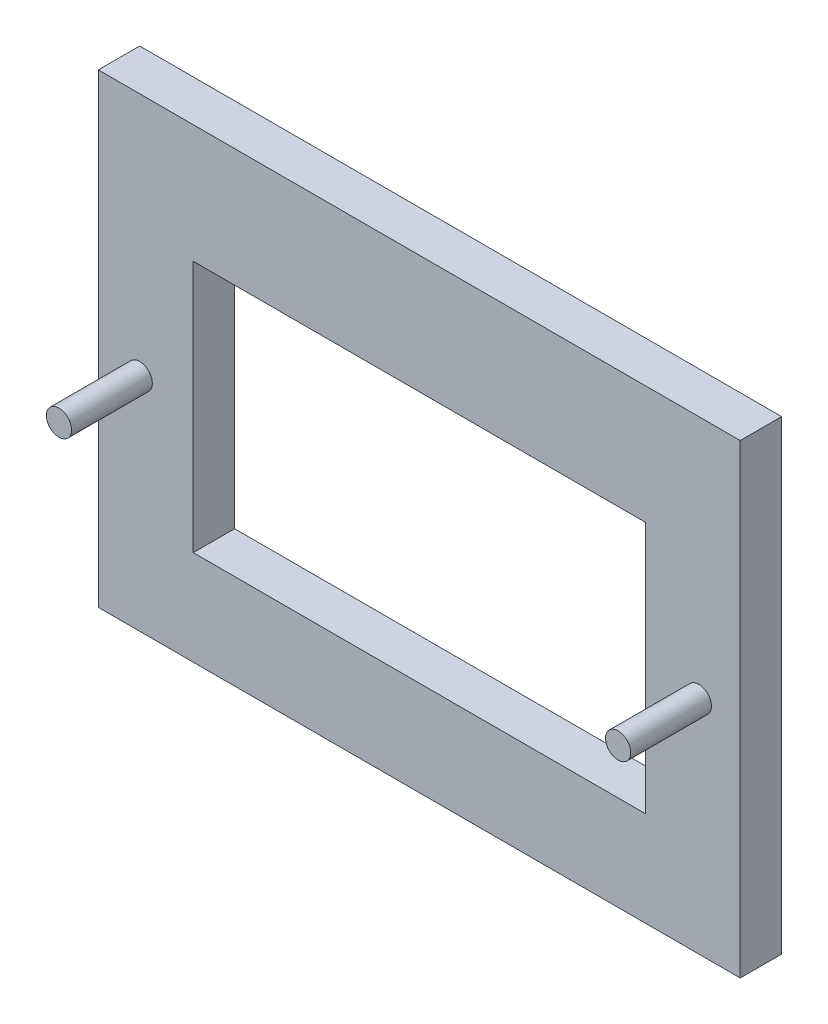
ISO-10303-21;
HEADER;
FILE_DESCRIPTION(('STEP AP214'),'2;1');
FILE_NAME('part.step','',(''),(''),'','','');
FILE_SCHEMA(('AUTOMOTIVE_DESIGN { 1 0 10303 214 1 1 1 1 }'));
ENDSEC;
DATA;
#1=APPLICATION_CONTEXT('core data for automotive mechanical design processes');
#2=APPLICATION_PROTOCOL_DEFINITION('international standard','automotive_design',2000,#1);
#3=PRODUCT_CONTEXT('',#1,'mechanical');
#4=PRODUCT('Part','Part','',(#3));
#5=PRODUCT_RELATED_PRODUCT_CATEGORY('part','',(#4));
#6=PRODUCT_DEFINITION_FORMATION('','',#4);
#7=PRODUCT_DEFINITION_CONTEXT('part definition',#1,'design');
#8=PRODUCT_DEFINITION('design','',#6,#7);
#9=PRODUCT_DEFINITION_SHAPE('','',#8);
#10=(LENGTH_UNIT() NAMED_UNIT(*) SI_UNIT(.MILLI.,.METRE.));
#11=(NAMED_UNIT(*) PLANE_ANGLE_UNIT() SI_UNIT($,.RADIAN.));
#12=(NAMED_UNIT(*) SI_UNIT($,.STERADIAN.) SOLID_ANGLE_UNIT());
#13=UNCERTAINTY_MEASURE_WITH_UNIT(LENGTH_MEASURE(1.E-05),#10,'distance_accuracy_value','');
#14=(GEOMETRIC_REPRESENTATION_CONTEXT(3) GLOBAL_UNCERTAINTY_ASSIGNED_CONTEXT((#13)) GLOBAL_UNIT_ASSIGNED_CONTEXT((#10,
#11,#12)) REPRESENTATION_CONTEXT('',''));
#15=CARTESIAN_POINT('',(0.,0.,0.));
#16=DIRECTION('',(0.,0.,1.));
#17=DIRECTION('',(1.,0.,0.));
#18=AXIS2_PLACEMENT_3D('',#15,#16,#17);
#19=CARTESIAN_POINT('',(29.75,10.95,6.05));
#20=DIRECTION('',(0.,0.,-1.));
#21=DIRECTION('',(-1.,0.,0.));
#22=AXIS2_PLACEMENT_3D('',#19,#20,#21);
#23=CYLINDRICAL_SURFACE('',#22,0.625000000000006);
#24=CARTESIAN_POINT('',(29.75,10.95,6.05));
#25=DIRECTION('',(0.,0.,1.));
#26=DIRECTION('',(1.,0.,0.));
#27=AXIS2_PLACEMENT_3D('',#24,#25,#26);
#28=CIRCLE('',#27,0.625000000000006);
#29=CARTESIAN_POINT('',(30.375,10.95,6.05));
#30=VERTEX_POINT('',#29);
#31=EDGE_CURVE('E11',#30,#30,#28,.T.);
#32=ORIENTED_EDGE('',*,*,#31,.F.);
#33=EDGE_LOOP('',(#32));
#34=FACE_BOUND('',#33,.T.);
#35=CARTESIAN_POINT('',(29.75,10.95,2.05));
#36=DIRECTION('',(0.,0.,1.));
#37=DIRECTION('',(1.,0.,0.));
#38=AXIS2_PLACEMENT_3D('',#35,#36,#37);
#39=CIRCLE('',#38,0.625000000000006);
#40=CARTESIAN_POINT('',(30.375,10.95,2.05));
#41=VERTEX_POINT('',#40);
#42=EDGE_CURVE('E45',#41,#41,#39,.T.);
#43=ORIENTED_EDGE('',*,*,#42,.T.);
#44=EDGE_LOOP('',(#43));
#45=FACE_BOUND('',#44,.T.);
#46=ADVANCED_FACE('F42',(#34,#45),#23,.T.);
#47=CARTESIAN_POINT('',(29.75,10.95,6.05));
#48=DIRECTION('',(0.,0.,1.));
#49=DIRECTION('',(1.,0.,0.));
#50=AXIS2_PLACEMENT_3D('',#47,#48,#49);
#51=PLANE('',#50);
#52=ORIENTED_EDGE('',*,*,#31,.T.);
#53=EDGE_LOOP('',(#52));
#54=FACE_BOUND('',#53,.T.);
#55=ADVANCED_FACE('F57',(#54),#51,.T.);
#56=CARTESIAN_POINT('',(29.75,10.95,2.05));
#57=DIRECTION('',(0.,0.,1.));
#58=DIRECTION('',(1.,0.,0.));
#59=AXIS2_PLACEMENT_3D('',#56,#57,#58);
#60=PLANE('',#59);
#61=ORIENTED_EDGE('',*,*,#42,.F.);
#62=EDGE_LOOP('',(#61));
#63=FACE_BOUND('',#62,.T.);
#64=ADVANCED_FACE('F55',(#63),#60,.F.);
#65=CLOSED_SHELL('',(#46,#55,#64));
#66=MANIFOLD_SOLID_BREP('B2',#65);
#67=CARTESIAN_POINT('',(2.05,10.95,6.05));
#68=DIRECTION('',(0.,0.,-1.));
#69=DIRECTION('',(-1.,0.,0.));
#70=AXIS2_PLACEMENT_3D('',#67,#68,#69);
#71=CYLINDRICAL_SURFACE('',#70,0.625);
#72=CARTESIAN_POINT('',(2.05,10.95,6.05));
#73=DIRECTION('',(0.,0.,1.));
#74=DIRECTION('',(1.,0.,0.));
#75=AXIS2_PLACEMENT_3D('',#72,#73,#74);
#76=CIRCLE('',#75,0.625);
#77=CARTESIAN_POINT('',(2.675,10.95,6.05));
#78=VERTEX_POINT('',#77);
#79=EDGE_CURVE('E41',#78,#78,#76,.T.);
#80=ORIENTED_EDGE('',*,*,#79,.F.);
#81=EDGE_LOOP('',(#80));
#82=FACE_BOUND('',#81,.T.);
#83=CARTESIAN_POINT('',(2.05,10.95,2.05));
#84=DIRECTION('',(0.,0.,1.));
#85=DIRECTION('',(1.,0.,0.));
#86=AXIS2_PLACEMENT_3D('',#83,#84,#85);
#87=CIRCLE('',#86,0.625);
#88=CARTESIAN_POINT('',(2.675,10.95,2.05));
#89=VERTEX_POINT('',#88);
#90=EDGE_CURVE('E95',#89,#89,#87,.T.);
#91=ORIENTED_EDGE('',*,*,#90,.T.);
#92=EDGE_LOOP('',(#91));
#93=FACE_BOUND('',#92,.T.);
#94=ADVANCED_FACE('F92',(#82,#93),#71,.T.);
#95=CARTESIAN_POINT('',(2.05,10.95,6.05));
#96=DIRECTION('',(0.,0.,1.));
#97=DIRECTION('',(1.,0.,0.));
#98=AXIS2_PLACEMENT_3D('',#95,#96,#97);
#99=PLANE('',#98);
#100=ORIENTED_EDGE('',*,*,#79,.T.);
#101=EDGE_LOOP('',(#100));
#102=FACE_BOUND('',#101,.T.);
#103=ADVANCED_FACE('F107',(#102),#99,.T.);
#104=CARTESIAN_POINT('',(2.05,10.95,2.05));
#105=DIRECTION('',(0.,0.,1.));
#106=DIRECTION('',(1.,0.,0.));
#107=AXIS2_PLACEMENT_3D('',#104,#105,#106);
#108=PLANE('',#107);
#109=ORIENTED_EDGE('',*,*,#90,.F.);
#110=EDGE_LOOP('',(#109));
#111=FACE_BOUND('',#110,.T.);
#112=ADVANCED_FACE('F105',(#111),#108,.F.);
#113=CLOSED_SHELL('',(#94,#103,#112));
#114=MANIFOLD_SOLID_BREP('B6',#113);
#115=CARTESIAN_POINT('',(0.,0.,2.05));
#116=DIRECTION('',(0.,1.,0.));
#117=DIRECTION('',(0.,0.,1.));
#118=AXIS2_PLACEMENT_3D('',#115,#116,#117);
#119=PLANE('',#118);
#120=DIRECTION('',(1.,0.,0.));
#121=VECTOR('',#120,1.);
#122=CARTESIAN_POINT('',(0.,0.,0.));
#123=LINE('',#122,#121);
#124=CARTESIAN_POINT('',(0.,0.,0.));
#125=VERTEX_POINT('',#124);
#126=CARTESIAN_POINT('',(31.8,0.,0.));
#127=VERTEX_POINT('',#126);
#128=EDGE_CURVE('E248',#125,#127,#123,.T.);
#129=ORIENTED_EDGE('',*,*,#128,.T.);
#130=DIRECTION('',(0.,0.,-1.));
#131=VECTOR('',#130,1.);
#132=CARTESIAN_POINT('',(31.8,0.,2.05));
#133=LINE('',#132,#131);
#134=CARTESIAN_POINT('',(31.8,0.,2.05));
#135=VERTEX_POINT('',#134);
#136=EDGE_CURVE('E90',#135,#127,#133,.T.);
#137=ORIENTED_EDGE('',*,*,#136,.F.);
#138=DIRECTION('',(1.,0.,0.));
#139=VECTOR('',#138,1.);
#140=CARTESIAN_POINT('',(0.,0.,2.05));
#141=LINE('',#140,#139);
#142=CARTESIAN_POINT('',(0.,0.,2.05));
#143=VERTEX_POINT('',#142);
#144=EDGE_CURVE('E213',#143,#135,#141,.T.);
#145=ORIENTED_EDGE('',*,*,#144,.F.);
#146=DIRECTION('',(0.,0.,-1.));
#147=VECTOR('',#146,1.);
#148=CARTESIAN_POINT('',(0.,0.,2.05));
#149=LINE('',#148,#147);
#150=EDGE_CURVE('E152',#143,#125,#149,.T.);
#151=ORIENTED_EDGE('',*,*,#150,.T.);
#152=EDGE_LOOP('',(#129,#137,#145,#151));
#153=FACE_BOUND('',#152,.T.);
#154=ADVANCED_FACE('F133',(#153),#119,.F.);
#155=CARTESIAN_POINT('',(31.8,0.,2.05));
#156=DIRECTION('',(-1.,0.,0.));
#157=DIRECTION('',(0.,0.,1.));
#158=AXIS2_PLACEMENT_3D('',#155,#156,#157);
#159=PLANE('',#158);
#160=DIRECTION('',(0.,1.,0.));
#161=VECTOR('',#160,1.);
#162=CARTESIAN_POINT('',(31.8,0.,0.));
#163=LINE('',#162,#161);
#164=CARTESIAN_POINT('',(31.8,23.06,0.));
#165=VERTEX_POINT('',#164);
#166=EDGE_CURVE('E219',#127,#165,#163,.T.);
#167=ORIENTED_EDGE('',*,*,#166,.T.);
#168=DIRECTION('',(0.,0.,-1.));
#169=VECTOR('',#168,1.);
#170=CARTESIAN_POINT('',(31.8,23.06,2.05));
#171=LINE('',#170,#169);
#172=CARTESIAN_POINT('',(31.8,23.06,2.05));
#173=VERTEX_POINT('',#172);
#174=EDGE_CURVE('E143',#173,#165,#171,.T.);
#175=ORIENTED_EDGE('',*,*,#174,.F.);
#176=DIRECTION('',(0.,1.,0.));
#177=VECTOR('',#176,1.);
#178=CARTESIAN_POINT('',(31.8,0.,2.05));
#179=LINE('',#178,#177);
#180=EDGE_CURVE('E207',#135,#173,#179,.T.);
#181=ORIENTED_EDGE('',*,*,#180,.F.);
#182=ORIENTED_EDGE('',*,*,#136,.T.);
#183=EDGE_LOOP('',(#167,#175,#181,#182));
#184=FACE_BOUND('',#183,.T.);
#185=ADVANCED_FACE('F218',(#184),#159,.F.);
#186=CARTESIAN_POINT('',(0.,23.06,2.05));
#187=DIRECTION('',(0.,-1.,0.));
#188=DIRECTION('',(0.,0.,-1.));
#189=AXIS2_PLACEMENT_3D('',#186,#187,#188);
#190=PLANE('',#189);
#191=DIRECTION('',(-1.,0.,0.));
#192=VECTOR('',#191,1.);
#193=CARTESIAN_POINT('',(0.,23.06,0.));
#194=LINE('',#193,#192);
#195=CARTESIAN_POINT('',(0.,23.06,0.));
#196=VERTEX_POINT('',#195);
#197=EDGE_CURVE('E251',#165,#196,#194,.T.);
#198=ORIENTED_EDGE('',*,*,#197,.T.);
#199=DIRECTION('',(0.,0.,-1.));
#200=VECTOR('',#199,1.);
#201=CARTESIAN_POINT('',(0.,23.06,2.05));
#202=LINE('',#201,#200);
#203=CARTESIAN_POINT('',(0.,23.06,2.05));
#204=VERTEX_POINT('',#203);
#205=EDGE_CURVE('E179',#204,#196,#202,.T.);
#206=ORIENTED_EDGE('',*,*,#205,.F.);
#207=DIRECTION('',(-1.,0.,0.));
#208=VECTOR('',#207,1.);
#209=CARTESIAN_POINT('',(0.,23.06,2.05));
#210=LINE('',#209,#208);
#211=EDGE_CURVE('E212',#173,#204,#210,.T.);
#212=ORIENTED_EDGE('',*,*,#211,.F.);
#213=ORIENTED_EDGE('',*,*,#174,.T.);
#214=EDGE_LOOP('',(#198,#206,#212,#213));
#215=FACE_BOUND('',#214,.T.);
#216=ADVANCED_FACE('F223',(#215),#190,.F.);
#217=CARTESIAN_POINT('',(0.,4.7,2.05));
#218=DIRECTION('',(0.,-1.,0.));
#219=DIRECTION('',(0.,0.,-1.));
#220=AXIS2_PLACEMENT_3D('',#217,#218,#219);
#221=PLANE('',#220);
#222=DIRECTION('',(-1.,0.,0.));
#223=VECTOR('',#222,1.);
#224=CARTESIAN_POINT('',(0.,4.7,0.));
#225=LINE('',#224,#223);
#226=CARTESIAN_POINT('',(27.1,4.7,0.));
#227=VERTEX_POINT('',#226);
#228=CARTESIAN_POINT('',(4.7,4.7,0.));
#229=VERTEX_POINT('',#228);
#230=EDGE_CURVE('E230',#227,#229,#225,.T.);
#231=ORIENTED_EDGE('',*,*,#230,.T.);
#232=DIRECTION('',(0.,0.,-1.));
#233=VECTOR('',#232,1.);
#234=CARTESIAN_POINT('',(4.7,4.7,2.05));
#235=LINE('',#234,#233);
#236=CARTESIAN_POINT('',(4.7,4.7,2.05));
#237=VERTEX_POINT('',#236);
#238=EDGE_CURVE('E137',#237,#229,#235,.T.);
#239=ORIENTED_EDGE('',*,*,#238,.F.);
#240=DIRECTION('',(-1.,0.,0.));
#241=VECTOR('',#240,1.);
#242=CARTESIAN_POINT('',(0.,4.7,2.05));
#243=LINE('',#242,#241);
#244=CARTESIAN_POINT('',(27.1,4.7,2.05));
#245=VERTEX_POINT('',#244);
#246=EDGE_CURVE('E256',#245,#237,#243,.T.);
#247=ORIENTED_EDGE('',*,*,#246,.F.);
#248=DIRECTION('',(0.,0.,-1.));
#249=VECTOR('',#248,1.);
#250=CARTESIAN_POINT('',(27.1,4.7,2.05));
#251=LINE('',#250,#249);
#252=EDGE_CURVE('E226',#245,#227,#251,.T.);
#253=ORIENTED_EDGE('',*,*,#252,.T.);
#254=EDGE_LOOP('',(#231,#239,#247,#253));
#255=FACE_BOUND('',#254,.T.);
#256=ADVANCED_FACE('F135',(#255),#221,.F.);
#257=CARTESIAN_POINT('',(4.7,0.,2.05));
#258=DIRECTION('',(-1.,0.,0.));
#259=DIRECTION('',(0.,0.,1.));
#260=AXIS2_PLACEMENT_3D('',#257,#258,#259);
#261=PLANE('',#260);
#262=DIRECTION('',(0.,1.,0.));
#263=VECTOR('',#262,1.);
#264=CARTESIAN_POINT('',(4.7,0.,0.));
#265=LINE('',#264,#263);
#266=CARTESIAN_POINT('',(4.7,17.2,0.));
#267=VERTEX_POINT('',#266);
#268=EDGE_CURVE('E233',#229,#267,#265,.T.);
#269=ORIENTED_EDGE('',*,*,#268,.T.);
#270=DIRECTION('',(0.,0.,-1.));
#271=VECTOR('',#270,1.);
#272=CARTESIAN_POINT('',(4.7,17.2,2.05));
#273=LINE('',#272,#271);
#274=CARTESIAN_POINT('',(4.7,17.2,2.05));
#275=VERTEX_POINT('',#274);
#276=EDGE_CURVE('E261',#275,#267,#273,.T.);
#277=ORIENTED_EDGE('',*,*,#276,.F.);
#278=DIRECTION('',(0.,1.,0.));
#279=VECTOR('',#278,1.);
#280=CARTESIAN_POINT('',(4.7,0.,2.05));
#281=LINE('',#280,#279);
#282=EDGE_CURVE('E192',#237,#275,#281,.T.);
#283=ORIENTED_EDGE('',*,*,#282,.F.);
#284=ORIENTED_EDGE('',*,*,#238,.T.);
#285=EDGE_LOOP('',(#269,#277,#283,#284));
#286=FACE_BOUND('',#285,.T.);
#287=ADVANCED_FACE('F266',(#286),#261,.F.);
#288=CARTESIAN_POINT('',(0.,17.2,2.05));
#289=DIRECTION('',(0.,-1.,0.));
#290=DIRECTION('',(0.,0.,-1.));
#291=AXIS2_PLACEMENT_3D('',#288,#289,#290);
#292=PLANE('',#291);
#293=DIRECTION('',(-1.,0.,0.));
#294=VECTOR('',#293,1.);
#295=CARTESIAN_POINT('',(0.,17.2,0.));
#296=LINE('',#295,#294);
#297=CARTESIAN_POINT('',(27.1,17.2,0.));
#298=VERTEX_POINT('',#297);
#299=EDGE_CURVE('E236',#298,#267,#296,.T.);
#300=ORIENTED_EDGE('',*,*,#299,.F.);
#301=DIRECTION('',(0.,0.,-1.));
#302=VECTOR('',#301,1.);
#303=CARTESIAN_POINT('',(27.1,17.2,2.05));
#304=LINE('',#303,#302);
#305=CARTESIAN_POINT('',(27.1,17.2,2.05));
#306=VERTEX_POINT('',#305);
#307=EDGE_CURVE('E260',#306,#298,#304,.T.);
#308=ORIENTED_EDGE('',*,*,#307,.F.);
#309=DIRECTION('',(-1.,0.,0.));
#310=VECTOR('',#309,1.);
#311=CARTESIAN_POINT('',(0.,17.2,2.05));
#312=LINE('',#311,#310);
#313=EDGE_CURVE('E414',#306,#275,#312,.T.);
#314=ORIENTED_EDGE('',*,*,#313,.T.);
#315=ORIENTED_EDGE('',*,*,#276,.T.);
#316=EDGE_LOOP('',(#300,#308,#314,#315));
#317=FACE_BOUND('',#316,.T.);
#318=ADVANCED_FACE('F280',(#317),#292,.T.);
#319=CARTESIAN_POINT('',(29.75,10.95,2.05));
#320=DIRECTION('',(0.,0.,-1.));
#321=DIRECTION('',(-1.,0.,0.));
#322=AXIS2_PLACEMENT_3D('',#319,#320,#321);
#323=CYLINDRICAL_SURFACE('',#322,0.625000000000002);
#324=CARTESIAN_POINT('',(29.75,10.95,2.05));
#325=DIRECTION('',(0.,0.,1.));
#326=DIRECTION('',(1.,0.,0.));
#327=AXIS2_PLACEMENT_3D('',#324,#325,#326);
#328=CIRCLE('',#327,0.625000000000002);
#329=CARTESIAN_POINT('',(30.375,10.95,2.05));
#330=VERTEX_POINT('',#329);
#331=EDGE_CURVE('E406',#330,#330,#328,.T.);
#332=ORIENTED_EDGE('',*,*,#331,.T.);
#333=EDGE_LOOP('',(#332));
#334=FACE_BOUND('',#333,.T.);
#335=CARTESIAN_POINT('',(29.75,10.95,0.));
#336=DIRECTION('',(0.,0.,1.));
#337=DIRECTION('',(1.,0.,0.));
#338=AXIS2_PLACEMENT_3D('',#335,#336,#337);
#339=CIRCLE('',#338,0.625000000000002);
#340=CARTESIAN_POINT('',(30.375,10.95,0.));
#341=VERTEX_POINT('',#340);
#342=EDGE_CURVE('E245',#341,#341,#339,.T.);
#343=ORIENTED_EDGE('',*,*,#342,.F.);
#344=EDGE_LOOP('',(#343));
#345=FACE_BOUND('',#344,.T.);
#346=ADVANCED_FACE('F282',(#334,#345),#323,.F.);
#347=CARTESIAN_POINT('',(2.05,10.95,2.05));
#348=DIRECTION('',(0.,0.,-1.));
#349=DIRECTION('',(-1.,0.,0.));
#350=AXIS2_PLACEMENT_3D('',#347,#348,#349);
#351=CYLINDRICAL_SURFACE('',#350,0.625);
#352=CARTESIAN_POINT('',(2.05,10.95,2.05));
#353=DIRECTION('',(0.,0.,1.));
#354=DIRECTION('',(1.,0.,0.));
#355=AXIS2_PLACEMENT_3D('',#352,#353,#354);
#356=CIRCLE('',#355,0.625);
#357=CARTESIAN_POINT('',(2.675,10.95,2.05));
#358=VERTEX_POINT('',#357);
#359=EDGE_CURVE('E408',#358,#358,#356,.T.);
#360=ORIENTED_EDGE('',*,*,#359,.T.);
#361=EDGE_LOOP('',(#360));
#362=FACE_BOUND('',#361,.T.);
#363=CARTESIAN_POINT('',(2.05,10.95,0.));
#364=DIRECTION('',(0.,0.,1.));
#365=DIRECTION('',(1.,0.,0.));
#366=AXIS2_PLACEMENT_3D('',#363,#364,#365);
#367=CIRCLE('',#366,0.625);
#368=CARTESIAN_POINT('',(2.675,10.95,0.));
#369=VERTEX_POINT('',#368);
#370=EDGE_CURVE('E242',#369,#369,#367,.T.);
#371=ORIENTED_EDGE('',*,*,#370,.F.);
#372=EDGE_LOOP('',(#371));
#373=FACE_BOUND('',#372,.T.);
#374=ADVANCED_FACE('F288',(#362,#373),#351,.F.);
#375=CARTESIAN_POINT('',(27.1,0.,2.05));
#376=DIRECTION('',(-1.,0.,0.));
#377=DIRECTION('',(0.,0.,1.));
#378=AXIS2_PLACEMENT_3D('',#375,#376,#377);
#379=PLANE('',#378);
#380=DIRECTION('',(0.,1.,0.));
#381=VECTOR('',#380,1.);
#382=CARTESIAN_POINT('',(27.1,0.,0.));
#383=LINE('',#382,#381);
#384=EDGE_CURVE('E239',#227,#298,#383,.T.);
#385=ORIENTED_EDGE('',*,*,#384,.F.);
#386=ORIENTED_EDGE('',*,*,#252,.F.);
#387=DIRECTION('',(0.,1.,0.));
#388=VECTOR('',#387,1.);
#389=CARTESIAN_POINT('',(27.1,0.,2.05));
#390=LINE('',#389,#388);
#391=EDGE_CURVE('E278',#245,#306,#390,.T.);
#392=ORIENTED_EDGE('',*,*,#391,.T.);
#393=ORIENTED_EDGE('',*,*,#307,.T.);
#394=EDGE_LOOP('',(#385,#386,#392,#393));
#395=FACE_BOUND('',#394,.T.);
#396=ADVANCED_FACE('F275',(#395),#379,.T.);
#397=CARTESIAN_POINT('',(0.,0.,2.05));
#398=DIRECTION('',(-1.,0.,0.));
#399=DIRECTION('',(0.,0.,1.));
#400=AXIS2_PLACEMENT_3D('',#397,#398,#399);
#401=PLANE('',#400);
#402=DIRECTION('',(0.,1.,0.));
#403=VECTOR('',#402,1.);
#404=CARTESIAN_POINT('',(0.,0.,0.));
#405=LINE('',#404,#403);
#406=EDGE_CURVE('E253',#125,#196,#405,.T.);
#407=ORIENTED_EDGE('',*,*,#406,.F.);
#408=ORIENTED_EDGE('',*,*,#150,.F.);
#409=DIRECTION('',(0.,1.,0.));
#410=VECTOR('',#409,1.);
#411=CARTESIAN_POINT('',(0.,0.,2.05));
#412=LINE('',#411,#410);
#413=EDGE_CURVE('E224',#143,#204,#412,.T.);
#414=ORIENTED_EDGE('',*,*,#413,.T.);
#415=ORIENTED_EDGE('',*,*,#205,.T.);
#416=EDGE_LOOP('',(#407,#408,#414,#415));
#417=FACE_BOUND('',#416,.T.);
#418=ADVANCED_FACE('F303',(#417),#401,.T.);
#419=CARTESIAN_POINT('',(0.,0.,2.05));
#420=DIRECTION('',(0.,0.,1.));
#421=DIRECTION('',(1.,0.,0.));
#422=AXIS2_PLACEMENT_3D('',#419,#420,#421);
#423=PLANE('',#422);
#424=ORIENTED_EDGE('',*,*,#246,.T.);
#425=ORIENTED_EDGE('',*,*,#282,.T.);
#426=ORIENTED_EDGE('',*,*,#313,.F.);
#427=ORIENTED_EDGE('',*,*,#391,.F.);
#428=EDGE_LOOP('',(#424,#425,#426,#427));
#429=FACE_BOUND('',#428,.T.);
#430=ORIENTED_EDGE('',*,*,#359,.F.);
#431=EDGE_LOOP('',(#430));
#432=FACE_BOUND('',#431,.T.);
#433=ORIENTED_EDGE('',*,*,#331,.F.);
#434=EDGE_LOOP('',(#433));
#435=FACE_BOUND('',#434,.T.);
#436=ORIENTED_EDGE('',*,*,#144,.T.);
#437=ORIENTED_EDGE('',*,*,#180,.T.);
#438=ORIENTED_EDGE('',*,*,#211,.T.);
#439=ORIENTED_EDGE('',*,*,#413,.F.);
#440=EDGE_LOOP('',(#436,#437,#438,#439));
#441=FACE_BOUND('',#440,.T.);
#442=ADVANCED_FACE('F209',(#429,#432,#435,#441),#423,.T.);
#443=CARTESIAN_POINT('',(0.,0.,0.));
#444=DIRECTION('',(0.,0.,1.));
#445=DIRECTION('',(1.,0.,0.));
#446=AXIS2_PLACEMENT_3D('',#443,#444,#445);
#447=PLANE('',#446);
#448=ORIENTED_EDGE('',*,*,#230,.F.);
#449=ORIENTED_EDGE('',*,*,#384,.T.);
#450=ORIENTED_EDGE('',*,*,#299,.T.);
#451=ORIENTED_EDGE('',*,*,#268,.F.);
#452=EDGE_LOOP('',(#448,#449,#450,#451));
#453=FACE_BOUND('',#452,.T.);
#454=ORIENTED_EDGE('',*,*,#370,.T.);
#455=EDGE_LOOP('',(#454));
#456=FACE_BOUND('',#455,.T.);
#457=ORIENTED_EDGE('',*,*,#342,.T.);
#458=EDGE_LOOP('',(#457));
#459=FACE_BOUND('',#458,.T.);
#460=ORIENTED_EDGE('',*,*,#128,.F.);
#461=ORIENTED_EDGE('',*,*,#406,.T.);
#462=ORIENTED_EDGE('',*,*,#197,.F.);
#463=ORIENTED_EDGE('',*,*,#166,.F.);
#464=EDGE_LOOP('',(#460,#461,#462,#463));
#465=FACE_BOUND('',#464,.T.);
#466=ADVANCED_FACE('F272',(#453,#456,#459,#465),#447,.F.);
#467=CLOSED_SHELL('',(#154,#185,#216,#256,#287,#318,#346,#374,#396,#418,#442,#466));
#468=MANIFOLD_SOLID_BREP('B36',#467);
#469=ADVANCED_BREP_SHAPE_REPRESENTATION('',(#18,#66,#114,#468),#14);
#470=SHAPE_DEFINITION_REPRESENTATION(#9,#469);
ENDSEC;
END-ISO-10303-21;
